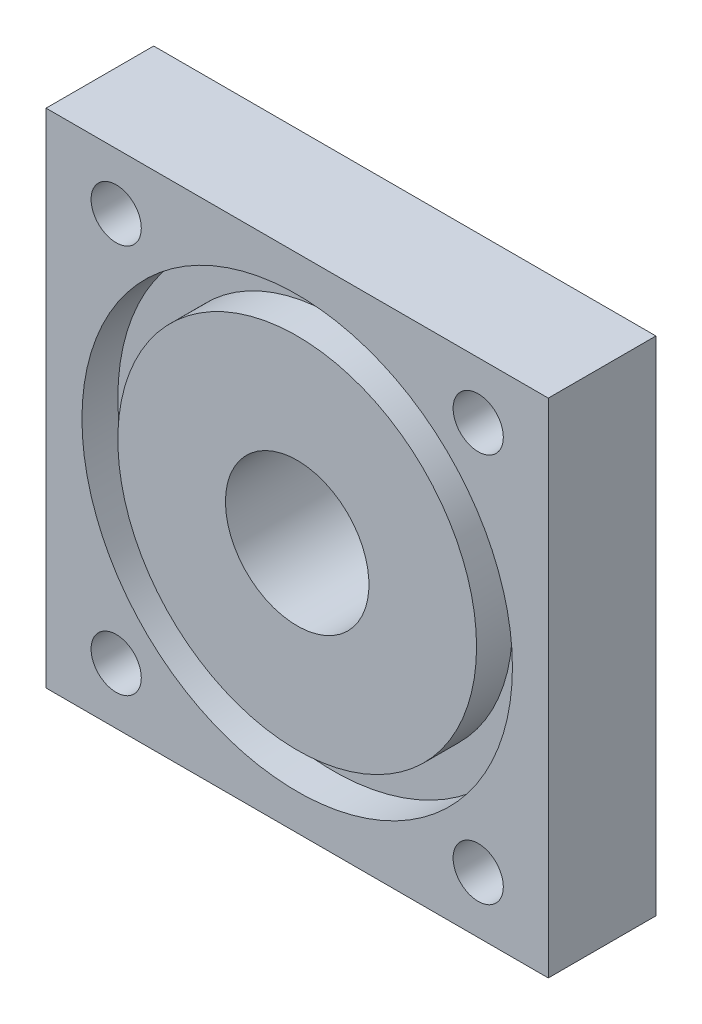
ISO-10303-21;
HEADER;
FILE_DESCRIPTION(('STEP AP214'),'2;1');
FILE_NAME('part.step','',(''),(''),'','','');
FILE_SCHEMA(('AUTOMOTIVE_DESIGN { 1 0 10303 214 1 1 1 1 }'));
ENDSEC;
DATA;
#1=APPLICATION_CONTEXT('core data for automotive mechanical design processes');
#2=APPLICATION_PROTOCOL_DEFINITION('international standard','automotive_design',2000,#1);
#3=PRODUCT_CONTEXT('',#1,'mechanical');
#4=PRODUCT('Part','Part','',(#3));
#5=PRODUCT_RELATED_PRODUCT_CATEGORY('part','',(#4));
#6=PRODUCT_DEFINITION_FORMATION('','',#4);
#7=PRODUCT_DEFINITION_CONTEXT('part definition',#1,'design');
#8=PRODUCT_DEFINITION('design','',#6,#7);
#9=PRODUCT_DEFINITION_SHAPE('','',#8);
#10=(LENGTH_UNIT() NAMED_UNIT(*) SI_UNIT(.MILLI.,.METRE.));
#11=(NAMED_UNIT(*) PLANE_ANGLE_UNIT() SI_UNIT($,.RADIAN.));
#12=(NAMED_UNIT(*) SI_UNIT($,.STERADIAN.) SOLID_ANGLE_UNIT());
#13=UNCERTAINTY_MEASURE_WITH_UNIT(LENGTH_MEASURE(1.E-05),#10,'distance_accuracy_value','');
#14=(GEOMETRIC_REPRESENTATION_CONTEXT(3) GLOBAL_UNCERTAINTY_ASSIGNED_CONTEXT((#13)) GLOBAL_UNIT_ASSIGNED_CONTEXT((#10,
#11,#12)) REPRESENTATION_CONTEXT('',''));
#15=CARTESIAN_POINT('',(0.,0.,0.));
#16=DIRECTION('',(0.,0.,1.));
#17=DIRECTION('',(1.,0.,0.));
#18=AXIS2_PLACEMENT_3D('',#15,#16,#17);
#19=CARTESIAN_POINT('',(35.,-35.,15.));
#20=DIRECTION('',(-1.,0.,0.));
#21=DIRECTION('',(0.,0.,1.));
#22=AXIS2_PLACEMENT_3D('',#19,#20,#21);
#23=PLANE('',#22);
#24=DIRECTION('',(0.,1.,0.));
#25=VECTOR('',#24,1.);
#26=CARTESIAN_POINT('',(35.,-35.,0.));
#27=LINE('',#26,#25);
#28=CARTESIAN_POINT('',(35.,-35.,0.));
#29=VERTEX_POINT('',#28);
#30=CARTESIAN_POINT('',(35.,35.,0.));
#31=VERTEX_POINT('',#30);
#32=EDGE_CURVE('E96',#29,#31,#27,.T.);
#33=ORIENTED_EDGE('',*,*,#32,.T.);
#34=DIRECTION('',(0.,0.,-1.));
#35=VECTOR('',#34,1.);
#36=CARTESIAN_POINT('',(35.,35.,15.));
#37=LINE('',#36,#35);
#38=CARTESIAN_POINT('',(35.,35.,15.));
#39=VERTEX_POINT('',#38);
#40=EDGE_CURVE('E11',#39,#31,#37,.T.);
#41=ORIENTED_EDGE('',*,*,#40,.F.);
#42=DIRECTION('',(0.,1.,0.));
#43=VECTOR('',#42,1.);
#44=CARTESIAN_POINT('',(35.,-35.,15.));
#45=LINE('',#44,#43);
#46=CARTESIAN_POINT('',(35.,-35.,15.));
#47=VERTEX_POINT('',#46);
#48=EDGE_CURVE('E84',#47,#39,#45,.T.);
#49=ORIENTED_EDGE('',*,*,#48,.F.);
#50=DIRECTION('',(0.,0.,-1.));
#51=VECTOR('',#50,1.);
#52=CARTESIAN_POINT('',(35.,-35.,15.));
#53=LINE('',#52,#51);
#54=EDGE_CURVE('E92',#47,#29,#53,.T.);
#55=ORIENTED_EDGE('',*,*,#54,.T.);
#56=EDGE_LOOP('',(#33,#41,#49,#55));
#57=FACE_BOUND('',#56,.T.);
#58=ADVANCED_FACE('F33',(#57),#23,.F.);
#59=CARTESIAN_POINT('',(-35.,35.,15.));
#60=DIRECTION('',(0.,-1.,0.));
#61=DIRECTION('',(0.,0.,-1.));
#62=AXIS2_PLACEMENT_3D('',#59,#60,#61);
#63=PLANE('',#62);
#64=DIRECTION('',(-1.,0.,0.));
#65=VECTOR('',#64,1.);
#66=CARTESIAN_POINT('',(-35.,35.,0.));
#67=LINE('',#66,#65);
#68=CARTESIAN_POINT('',(-35.,35.,0.));
#69=VERTEX_POINT('',#68);
#70=EDGE_CURVE('E88',#31,#69,#67,.T.);
#71=ORIENTED_EDGE('',*,*,#70,.T.);
#72=DIRECTION('',(0.,0.,-1.));
#73=VECTOR('',#72,1.);
#74=CARTESIAN_POINT('',(-35.,35.,15.));
#75=LINE('',#74,#73);
#76=CARTESIAN_POINT('',(-35.,35.,15.));
#77=VERTEX_POINT('',#76);
#78=EDGE_CURVE('E41',#77,#69,#75,.T.);
#79=ORIENTED_EDGE('',*,*,#78,.F.);
#80=DIRECTION('',(-1.,0.,0.));
#81=VECTOR('',#80,1.);
#82=CARTESIAN_POINT('',(-35.,35.,15.));
#83=LINE('',#82,#81);
#84=EDGE_CURVE('E79',#39,#77,#83,.T.);
#85=ORIENTED_EDGE('',*,*,#84,.F.);
#86=ORIENTED_EDGE('',*,*,#40,.T.);
#87=EDGE_LOOP('',(#71,#79,#85,#86));
#88=FACE_BOUND('',#87,.T.);
#89=ADVANCED_FACE('F87',(#88),#63,.F.);
#90=CARTESIAN_POINT('',(-35.,-35.,15.));
#91=DIRECTION('',(1.,0.,0.));
#92=DIRECTION('',(0.,0.,-1.));
#93=AXIS2_PLACEMENT_3D('',#90,#91,#92);
#94=PLANE('',#93);
#95=DIRECTION('',(0.,-1.,0.));
#96=VECTOR('',#95,1.);
#97=CARTESIAN_POINT('',(-35.,-35.,0.));
#98=LINE('',#97,#96);
#99=CARTESIAN_POINT('',(-35.,-35.,0.));
#100=VERTEX_POINT('',#99);
#101=EDGE_CURVE('E66',#69,#100,#98,.T.);
#102=ORIENTED_EDGE('',*,*,#101,.T.);
#103=DIRECTION('',(0.,0.,-1.));
#104=VECTOR('',#103,1.);
#105=CARTESIAN_POINT('',(-35.,-35.,15.));
#106=LINE('',#105,#104);
#107=CARTESIAN_POINT('',(-35.,-35.,15.));
#108=VERTEX_POINT('',#107);
#109=EDGE_CURVE('E89',#108,#100,#106,.T.);
#110=ORIENTED_EDGE('',*,*,#109,.F.);
#111=DIRECTION('',(0.,-1.,0.));
#112=VECTOR('',#111,1.);
#113=CARTESIAN_POINT('',(-35.,-35.,15.));
#114=LINE('',#113,#112);
#115=EDGE_CURVE('E82',#77,#108,#114,.T.);
#116=ORIENTED_EDGE('',*,*,#115,.F.);
#117=ORIENTED_EDGE('',*,*,#78,.T.);
#118=EDGE_LOOP('',(#102,#110,#116,#117));
#119=FACE_BOUND('',#118,.T.);
#120=ADVANCED_FACE('F90',(#119),#94,.F.);
#121=CARTESIAN_POINT('',(-35.,-35.,15.));
#122=DIRECTION('',(0.,1.,0.));
#123=DIRECTION('',(0.,0.,1.));
#124=AXIS2_PLACEMENT_3D('',#121,#122,#123);
#125=PLANE('',#124);
#126=DIRECTION('',(1.,0.,0.));
#127=VECTOR('',#126,1.);
#128=CARTESIAN_POINT('',(-35.,-35.,0.));
#129=LINE('',#128,#127);
#130=EDGE_CURVE('E72',#100,#29,#129,.T.);
#131=ORIENTED_EDGE('',*,*,#130,.T.);
#132=ORIENTED_EDGE('',*,*,#54,.F.);
#133=DIRECTION('',(1.,0.,0.));
#134=VECTOR('',#133,1.);
#135=CARTESIAN_POINT('',(-35.,-35.,15.));
#136=LINE('',#135,#134);
#137=EDGE_CURVE('E49',#108,#47,#136,.T.);
#138=ORIENTED_EDGE('',*,*,#137,.F.);
#139=ORIENTED_EDGE('',*,*,#109,.T.);
#140=EDGE_LOOP('',(#131,#132,#138,#139));
#141=FACE_BOUND('',#140,.T.);
#142=ADVANCED_FACE('F104',(#141),#125,.F.);
#143=CARTESIAN_POINT('',(0.,0.,15.));
#144=DIRECTION('',(0.,0.,-1.));
#145=DIRECTION('',(-1.,0.,0.));
#146=AXIS2_PLACEMENT_3D('',#143,#144,#145);
#147=PLANE('',#146);
#148=CARTESIAN_POINT('',(-25.2298633162863,-27.1379581950079,15.));
#149=DIRECTION('',(0.,0.,1.));
#150=DIRECTION('',(1.,0.,0.));
#151=AXIS2_PLACEMENT_3D('',#148,#149,#150);
#152=CIRCLE('',#151,3.5);
#153=CARTESIAN_POINT('',(-21.7298633162863,-27.1379581950079,15.));
#154=VERTEX_POINT('',#153);
#155=EDGE_CURVE('E122',#154,#154,#152,.T.);
#156=ORIENTED_EDGE('',*,*,#155,.F.);
#157=EDGE_LOOP('',(#156));
#158=FACE_BOUND('',#157,.T.);
#159=CARTESIAN_POINT('',(25.2298633162863,-27.1379581950079,15.));
#160=DIRECTION('',(0.,0.,1.));
#161=DIRECTION('',(1.,0.,0.));
#162=AXIS2_PLACEMENT_3D('',#159,#160,#161);
#163=CIRCLE('',#162,3.5);
#164=CARTESIAN_POINT('',(28.7298633162863,-27.1379581950079,15.));
#165=VERTEX_POINT('',#164);
#166=EDGE_CURVE('E125',#165,#165,#163,.T.);
#167=ORIENTED_EDGE('',*,*,#166,.F.);
#168=EDGE_LOOP('',(#167));
#169=FACE_BOUND('',#168,.T.);
#170=CARTESIAN_POINT('',(25.2298633162863,27.1379581950079,15.));
#171=DIRECTION('',(0.,0.,1.));
#172=DIRECTION('',(1.,0.,0.));
#173=AXIS2_PLACEMENT_3D('',#170,#171,#172);
#174=CIRCLE('',#173,3.5);
#175=CARTESIAN_POINT('',(28.7298633162863,27.1379581950079,15.));
#176=VERTEX_POINT('',#175);
#177=EDGE_CURVE('E129',#176,#176,#174,.T.);
#178=ORIENTED_EDGE('',*,*,#177,.F.);
#179=EDGE_LOOP('',(#178));
#180=FACE_BOUND('',#179,.T.);
#181=CARTESIAN_POINT('',(-25.2298633162863,27.1379581950079,15.));
#182=DIRECTION('',(0.,0.,1.));
#183=DIRECTION('',(1.,0.,0.));
#184=AXIS2_PLACEMENT_3D('',#181,#182,#183);
#185=CIRCLE('',#184,3.5);
#186=CARTESIAN_POINT('',(-21.7298633162863,27.1379581950079,15.));
#187=VERTEX_POINT('',#186);
#188=EDGE_CURVE('E119',#187,#187,#185,.T.);
#189=ORIENTED_EDGE('',*,*,#188,.F.);
#190=EDGE_LOOP('',(#189));
#191=FACE_BOUND('',#190,.T.);
#192=CARTESIAN_POINT('',(0.,0.,15.));
#193=DIRECTION('',(0.,0.,1.));
#194=DIRECTION('',(1.,0.,0.));
#195=AXIS2_PLACEMENT_3D('',#192,#193,#194);
#196=CIRCLE('',#195,30.);
#197=CARTESIAN_POINT('',(30.,0.,15.));
#198=VERTEX_POINT('',#197);
#199=EDGE_CURVE('E110',#198,#198,#196,.T.);
#200=ORIENTED_EDGE('',*,*,#199,.F.);
#201=EDGE_LOOP('',(#200));
#202=FACE_BOUND('',#201,.T.);
#203=ORIENTED_EDGE('',*,*,#48,.T.);
#204=ORIENTED_EDGE('',*,*,#84,.T.);
#205=ORIENTED_EDGE('',*,*,#115,.T.);
#206=ORIENTED_EDGE('',*,*,#137,.T.);
#207=EDGE_LOOP('',(#203,#204,#205,#206));
#208=FACE_BOUND('',#207,.T.);
#209=ADVANCED_FACE('F80',(#158,#169,#180,#191,#202,#208),#147,.F.);
#210=CARTESIAN_POINT('',(0.,0.,0.));
#211=DIRECTION('',(0.,0.,-1.));
#212=DIRECTION('',(-1.,0.,0.));
#213=AXIS2_PLACEMENT_3D('',#210,#211,#212);
#214=PLANE('',#213);
#215=CARTESIAN_POINT('',(0.,0.,0.));
#216=DIRECTION('',(0.,0.,-1.));
#217=DIRECTION('',(-1.,0.,0.));
#218=AXIS2_PLACEMENT_3D('',#215,#216,#217);
#219=CIRCLE('',#218,10.);
#220=CARTESIAN_POINT('',(-10.,0.,0.));
#221=VERTEX_POINT('',#220);
#222=EDGE_CURVE('E146',#221,#221,#219,.T.);
#223=ORIENTED_EDGE('',*,*,#222,.F.);
#224=EDGE_LOOP('',(#223));
#225=FACE_BOUND('',#224,.T.);
#226=CARTESIAN_POINT('',(-25.2298633162863,-27.1379581950079,0.));
#227=DIRECTION('',(0.,0.,1.));
#228=DIRECTION('',(1.,0.,0.));
#229=AXIS2_PLACEMENT_3D('',#226,#227,#228);
#230=CIRCLE('',#229,3.5);
#231=CARTESIAN_POINT('',(-21.7298633162863,-27.1379581950079,0.));
#232=VERTEX_POINT('',#231);
#233=EDGE_CURVE('E137',#232,#232,#230,.T.);
#234=ORIENTED_EDGE('',*,*,#233,.T.);
#235=EDGE_LOOP('',(#234));
#236=FACE_BOUND('',#235,.T.);
#237=CARTESIAN_POINT('',(25.2298633162863,-27.1379581950079,0.));
#238=DIRECTION('',(0.,0.,1.));
#239=DIRECTION('',(1.,0.,0.));
#240=AXIS2_PLACEMENT_3D('',#237,#238,#239);
#241=CIRCLE('',#240,3.5);
#242=CARTESIAN_POINT('',(28.7298633162863,-27.1379581950079,0.));
#243=VERTEX_POINT('',#242);
#244=EDGE_CURVE('E140',#243,#243,#241,.T.);
#245=ORIENTED_EDGE('',*,*,#244,.T.);
#246=EDGE_LOOP('',(#245));
#247=FACE_BOUND('',#246,.T.);
#248=CARTESIAN_POINT('',(25.2298633162863,27.1379581950079,0.));
#249=DIRECTION('',(0.,0.,1.));
#250=DIRECTION('',(1.,0.,0.));
#251=AXIS2_PLACEMENT_3D('',#248,#249,#250);
#252=CIRCLE('',#251,3.5);
#253=CARTESIAN_POINT('',(28.7298633162863,27.1379581950079,0.));
#254=VERTEX_POINT('',#253);
#255=EDGE_CURVE('E136',#254,#254,#252,.T.);
#256=ORIENTED_EDGE('',*,*,#255,.T.);
#257=EDGE_LOOP('',(#256));
#258=FACE_BOUND('',#257,.T.);
#259=CARTESIAN_POINT('',(-25.2298633162863,27.1379581950079,0.));
#260=DIRECTION('',(0.,0.,1.));
#261=DIRECTION('',(1.,0.,0.));
#262=AXIS2_PLACEMENT_3D('',#259,#260,#261);
#263=CIRCLE('',#262,3.5);
#264=CARTESIAN_POINT('',(-21.7298633162863,27.1379581950079,0.));
#265=VERTEX_POINT('',#264);
#266=EDGE_CURVE('E126',#265,#265,#263,.T.);
#267=ORIENTED_EDGE('',*,*,#266,.T.);
#268=EDGE_LOOP('',(#267));
#269=FACE_BOUND('',#268,.T.);
#270=ORIENTED_EDGE('',*,*,#32,.F.);
#271=ORIENTED_EDGE('',*,*,#130,.F.);
#272=ORIENTED_EDGE('',*,*,#101,.F.);
#273=ORIENTED_EDGE('',*,*,#70,.F.);
#274=EDGE_LOOP('',(#270,#271,#272,#273));
#275=FACE_BOUND('',#274,.T.);
#276=ADVANCED_FACE('F107',(#225,#236,#247,#258,#269,#275),#214,.T.);
#277=CARTESIAN_POINT('',(0.,0.,10.));
#278=DIRECTION('',(0.,0.,1.));
#279=DIRECTION('',(1.,0.,0.));
#280=AXIS2_PLACEMENT_3D('',#277,#278,#279);
#281=CYLINDRICAL_SURFACE('',#280,30.);
#282=CARTESIAN_POINT('',(0.,0.,10.));
#283=DIRECTION('',(0.,0.,1.));
#284=DIRECTION('',(1.,0.,0.));
#285=AXIS2_PLACEMENT_3D('',#282,#283,#284);
#286=CIRCLE('',#285,30.);
#287=CARTESIAN_POINT('',(30.,0.,10.));
#288=VERTEX_POINT('',#287);
#289=EDGE_CURVE('E99',#288,#288,#286,.T.);
#290=ORIENTED_EDGE('',*,*,#289,.F.);
#291=EDGE_LOOP('',(#290));
#292=FACE_BOUND('',#291,.T.);
#293=ORIENTED_EDGE('',*,*,#199,.T.);
#294=EDGE_LOOP('',(#293));
#295=FACE_BOUND('',#294,.T.);
#296=ADVANCED_FACE('F163',(#292,#295),#281,.F.);
#297=CARTESIAN_POINT('',(0.,0.,10.));
#298=DIRECTION('',(0.,0.,1.));
#299=DIRECTION('',(1.,0.,0.));
#300=AXIS2_PLACEMENT_3D('',#297,#298,#299);
#301=PLANE('',#300);
#302=CARTESIAN_POINT('',(0.,0.,10.));
#303=DIRECTION('',(0.,0.,1.));
#304=DIRECTION('',(1.,0.,0.));
#305=AXIS2_PLACEMENT_3D('',#302,#303,#304);
#306=CIRCLE('',#305,25.);
#307=CARTESIAN_POINT('',(25.,0.,10.));
#308=VERTEX_POINT('',#307);
#309=EDGE_CURVE('E113',#308,#308,#306,.T.);
#310=ORIENTED_EDGE('',*,*,#309,.F.);
#311=EDGE_LOOP('',(#310));
#312=FACE_BOUND('',#311,.T.);
#313=ORIENTED_EDGE('',*,*,#289,.T.);
#314=EDGE_LOOP('',(#313));
#315=FACE_BOUND('',#314,.T.);
#316=ADVANCED_FACE('F186',(#312,#315),#301,.T.);
#317=CARTESIAN_POINT('',(0.,0.,10.));
#318=DIRECTION('',(0.,0.,1.));
#319=DIRECTION('',(1.,0.,0.));
#320=AXIS2_PLACEMENT_3D('',#317,#318,#319);
#321=CYLINDRICAL_SURFACE('',#320,25.);
#322=ORIENTED_EDGE('',*,*,#309,.T.);
#323=EDGE_LOOP('',(#322));
#324=FACE_BOUND('',#323,.T.);
#325=CARTESIAN_POINT('',(0.,0.,15.));
#326=DIRECTION('',(0.,0.,1.));
#327=DIRECTION('',(1.,0.,0.));
#328=AXIS2_PLACEMENT_3D('',#325,#326,#327);
#329=CIRCLE('',#328,25.);
#330=CARTESIAN_POINT('',(25.,0.,15.));
#331=VERTEX_POINT('',#330);
#332=EDGE_CURVE('E116',#331,#331,#329,.T.);
#333=ORIENTED_EDGE('',*,*,#332,.F.);
#334=EDGE_LOOP('',(#333));
#335=FACE_BOUND('',#334,.T.);
#336=ADVANCED_FACE('F176',(#324,#335),#321,.T.);
#337=CARTESIAN_POINT('',(-25.2298633162863,27.1379581950079,10.));
#338=DIRECTION('',(0.,0.,1.));
#339=DIRECTION('',(1.,0.,0.));
#340=AXIS2_PLACEMENT_3D('',#337,#338,#339);
#341=CYLINDRICAL_SURFACE('',#340,3.5);
#342=ORIENTED_EDGE('',*,*,#188,.T.);
#343=EDGE_LOOP('',(#342));
#344=FACE_BOUND('',#343,.T.);
#345=ORIENTED_EDGE('',*,*,#266,.F.);
#346=EDGE_LOOP('',(#345));
#347=FACE_BOUND('',#346,.T.);
#348=ADVANCED_FACE('F173',(#344,#347),#341,.F.);
#349=CARTESIAN_POINT('',(25.2298633162863,27.1379581950079,10.));
#350=DIRECTION('',(0.,0.,1.));
#351=DIRECTION('',(1.,0.,0.));
#352=AXIS2_PLACEMENT_3D('',#349,#350,#351);
#353=CYLINDRICAL_SURFACE('',#352,3.5);
#354=ORIENTED_EDGE('',*,*,#177,.T.);
#355=EDGE_LOOP('',(#354));
#356=FACE_BOUND('',#355,.T.);
#357=ORIENTED_EDGE('',*,*,#255,.F.);
#358=EDGE_LOOP('',(#357));
#359=FACE_BOUND('',#358,.T.);
#360=ADVANCED_FACE('F175',(#356,#359),#353,.F.);
#361=CARTESIAN_POINT('',(25.2298633162863,-27.1379581950079,10.));
#362=DIRECTION('',(0.,0.,1.));
#363=DIRECTION('',(1.,0.,0.));
#364=AXIS2_PLACEMENT_3D('',#361,#362,#363);
#365=CYLINDRICAL_SURFACE('',#364,3.5);
#366=ORIENTED_EDGE('',*,*,#166,.T.);
#367=EDGE_LOOP('',(#366));
#368=FACE_BOUND('',#367,.T.);
#369=ORIENTED_EDGE('',*,*,#244,.F.);
#370=EDGE_LOOP('',(#369));
#371=FACE_BOUND('',#370,.T.);
#372=ADVANCED_FACE('F183',(#368,#371),#365,.F.);
#373=CARTESIAN_POINT('',(-25.2298633162863,-27.1379581950079,10.));
#374=DIRECTION('',(0.,0.,1.));
#375=DIRECTION('',(1.,0.,0.));
#376=AXIS2_PLACEMENT_3D('',#373,#374,#375);
#377=CYLINDRICAL_SURFACE('',#376,3.5);
#378=ORIENTED_EDGE('',*,*,#155,.T.);
#379=EDGE_LOOP('',(#378));
#380=FACE_BOUND('',#379,.T.);
#381=ORIENTED_EDGE('',*,*,#233,.F.);
#382=EDGE_LOOP('',(#381));
#383=FACE_BOUND('',#382,.T.);
#384=ADVANCED_FACE('F209',(#380,#383),#377,.F.);
#385=CARTESIAN_POINT('',(0.,0.,15.));
#386=DIRECTION('',(0.,0.,-1.));
#387=DIRECTION('',(-1.,0.,0.));
#388=AXIS2_PLACEMENT_3D('',#385,#386,#387);
#389=CIRCLE('',#388,10.);
#390=CARTESIAN_POINT('',(-10.,0.,15.));
#391=VERTEX_POINT('',#390);
#392=EDGE_CURVE('E141',#391,#391,#389,.T.);
#393=ORIENTED_EDGE('',*,*,#392,.T.);
#394=EDGE_LOOP('',(#393));
#395=FACE_BOUND('',#394,.T.);
#396=ORIENTED_EDGE('',*,*,#332,.T.);
#397=EDGE_LOOP('',(#396));
#398=FACE_BOUND('',#397,.T.);
#399=ADVANCED_FACE('F152',(#395,#398),#147,.F.);
#400=CARTESIAN_POINT('',(0.,0.,15.));
#401=DIRECTION('',(0.,0.,-1.));
#402=DIRECTION('',(-1.,0.,0.));
#403=AXIS2_PLACEMENT_3D('',#400,#401,#402);
#404=CYLINDRICAL_SURFACE('',#403,10.);
#405=ORIENTED_EDGE('',*,*,#392,.F.);
#406=EDGE_LOOP('',(#405));
#407=FACE_BOUND('',#406,.T.);
#408=ORIENTED_EDGE('',*,*,#222,.T.);
#409=EDGE_LOOP('',(#408));
#410=FACE_BOUND('',#409,.T.);
#411=ADVANCED_FACE('F155',(#407,#410),#404,.F.);
#412=CLOSED_SHELL('',(#58,#89,#120,#142,#209,#276,#296,#316,#336,#348,#360,#372,#384,#399,#411));
#413=MANIFOLD_SOLID_BREP('B2',#412);
#414=ADVANCED_BREP_SHAPE_REPRESENTATION('',(#18,#413),#14);
#415=SHAPE_DEFINITION_REPRESENTATION(#9,#414);
ENDSEC;
END-ISO-10303-21;
